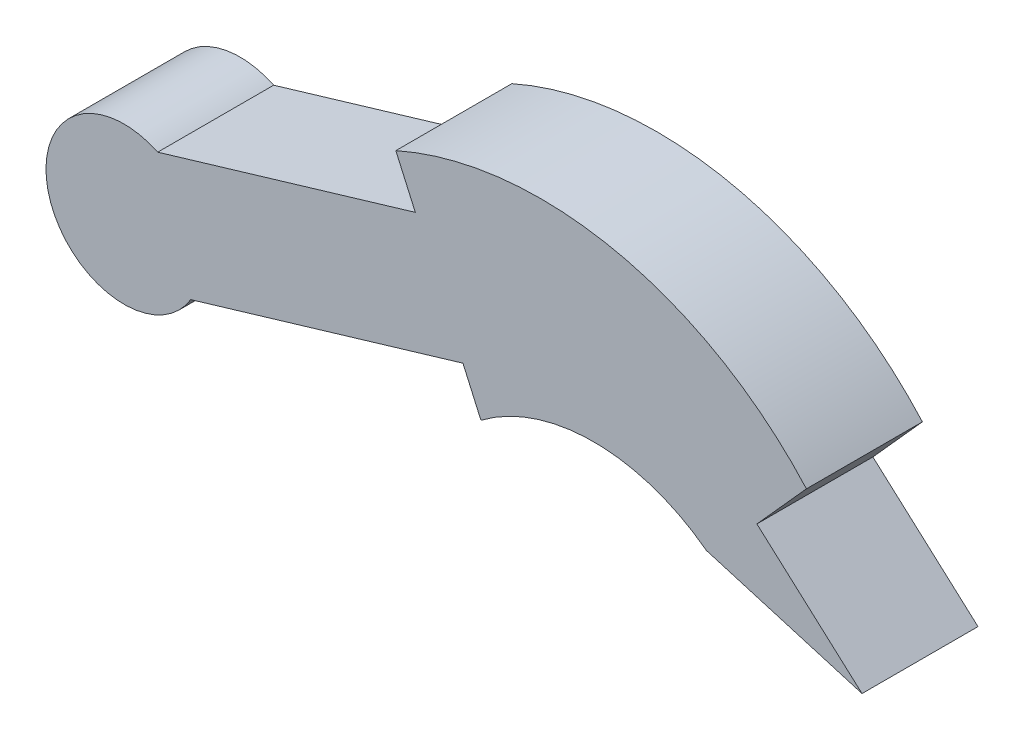
ISO-10303-21;
HEADER;
FILE_DESCRIPTION(('STEP AP214'),'2;1');
FILE_NAME('part.step','',(''),(''),'','','');
FILE_SCHEMA(('AUTOMOTIVE_DESIGN { 1 0 10303 214 1 1 1 1 }'));
ENDSEC;
DATA;
#1=APPLICATION_CONTEXT('core data for automotive mechanical design processes');
#2=APPLICATION_PROTOCOL_DEFINITION('international standard','automotive_design',2000,#1);
#3=PRODUCT_CONTEXT('',#1,'mechanical');
#4=PRODUCT('Part','Part','',(#3));
#5=PRODUCT_RELATED_PRODUCT_CATEGORY('part','',(#4));
#6=PRODUCT_DEFINITION_FORMATION('','',#4);
#7=PRODUCT_DEFINITION_CONTEXT('part definition',#1,'design');
#8=PRODUCT_DEFINITION('design','',#6,#7);
#9=PRODUCT_DEFINITION_SHAPE('','',#8);
#10=(LENGTH_UNIT() NAMED_UNIT(*) SI_UNIT(.MILLI.,.METRE.));
#11=(NAMED_UNIT(*) PLANE_ANGLE_UNIT() SI_UNIT($,.RADIAN.));
#12=(NAMED_UNIT(*) SI_UNIT($,.STERADIAN.) SOLID_ANGLE_UNIT());
#13=UNCERTAINTY_MEASURE_WITH_UNIT(LENGTH_MEASURE(1.E-05),#10,'distance_accuracy_value','');
#14=(GEOMETRIC_REPRESENTATION_CONTEXT(3) GLOBAL_UNCERTAINTY_ASSIGNED_CONTEXT((#13)) GLOBAL_UNIT_ASSIGNED_CONTEXT((#10,
#11,#12)) REPRESENTATION_CONTEXT('',''));
#15=CARTESIAN_POINT('',(0.,0.,0.));
#16=DIRECTION('',(0.,0.,1.));
#17=DIRECTION('',(1.,0.,0.));
#18=AXIS2_PLACEMENT_3D('',#15,#16,#17);
#19=CARTESIAN_POINT('',(24.5766985358955,0.531806480141832,-1.524));
#20=DIRECTION('',(0.,0.,1.));
#21=DIRECTION('',(1.,0.,0.));
#22=AXIS2_PLACEMENT_3D('',#19,#20,#21);
#23=CYLINDRICAL_SURFACE('',#22,1.02629268711818);
#24=CARTESIAN_POINT('',(24.5766985358955,0.531806480141832,0.));
#25=DIRECTION('',(0.,0.,1.));
#26=DIRECTION('',(-1.,0.,0.));
#27=AXIS2_PLACEMENT_3D('',#24,#25,#26);
#28=CIRCLE('',#27,1.02629268711818);
#29=CARTESIAN_POINT('',(25.018211481011,1.45827450383597,0.));
#30=VERTEX_POINT('',#29);
#31=CARTESIAN_POINT('',(25.4530060528673,-0.00238619608178983,0.));
#32=VERTEX_POINT('',#31);
#33=EDGE_CURVE('E142',#30,#32,#28,.T.);
#34=ORIENTED_EDGE('',*,*,#33,.F.);
#35=DIRECTION('',(0.,0.,1.));
#36=VECTOR('',#35,1.);
#37=CARTESIAN_POINT('',(25.018211481011,1.45827450383597,-1.524));
#38=LINE('',#37,#36);
#39=CARTESIAN_POINT('',(25.018211481011,1.45827450383597,-1.524));
#40=VERTEX_POINT('',#39);
#41=EDGE_CURVE('E11',#40,#30,#38,.T.);
#42=ORIENTED_EDGE('',*,*,#41,.F.);
#43=CARTESIAN_POINT('',(24.5766985358955,0.531806480141832,-1.524));
#44=DIRECTION('',(0.,0.,1.));
#45=DIRECTION('',(-1.,0.,0.));
#46=AXIS2_PLACEMENT_3D('',#43,#44,#45);
#47=CIRCLE('',#46,1.02629268711818);
#48=CARTESIAN_POINT('',(25.4530060528673,-0.00238619608178983,-1.524));
#49=VERTEX_POINT('',#48);
#50=EDGE_CURVE('E168',#40,#49,#47,.T.);
#51=ORIENTED_EDGE('',*,*,#50,.T.);
#52=DIRECTION('',(0.,0.,1.));
#53=VECTOR('',#52,1.);
#54=CARTESIAN_POINT('',(25.4530060528673,-0.00238619608178983,-1.524));
#55=LINE('',#54,#53);
#56=EDGE_CURVE('E36',#49,#32,#55,.T.);
#57=ORIENTED_EDGE('',*,*,#56,.T.);
#58=EDGE_LOOP('',(#34,#42,#51,#57));
#59=FACE_BOUND('',#58,.T.);
#60=ADVANCED_FACE('F33',(#59),#23,.T.);
#61=CARTESIAN_POINT('',(25.018211481011,1.45827450383597,-1.524));
#62=DIRECTION('',(-0.285298275496244,0.958438779473613,0.));
#63=DIRECTION('',(-0.958438779473613,-0.285298275496244,0.));
#64=AXIS2_PLACEMENT_3D('',#61,#62,#63);
#65=PLANE('',#64);
#66=DIRECTION('',(-0.958438779473613,-0.285298275496244,0.));
#67=VECTOR('',#66,1.);
#68=CARTESIAN_POINT('',(25.018211481011,1.45827450383597,0.));
#69=LINE('',#68,#67);
#70=CARTESIAN_POINT('',(28.4030245013134,2.46583110343419,0.));
#71=VERTEX_POINT('',#70);
#72=EDGE_CURVE('E166',#71,#30,#69,.T.);
#73=ORIENTED_EDGE('',*,*,#72,.F.);
#74=DIRECTION('',(0.,0.,1.));
#75=VECTOR('',#74,1.);
#76=CARTESIAN_POINT('',(28.4030245013134,2.46583110343419,-1.524));
#77=LINE('',#76,#75);
#78=CARTESIAN_POINT('',(28.4030245013134,2.46583110343419,-1.524));
#79=VERTEX_POINT('',#78);
#80=EDGE_CURVE('E42',#79,#71,#77,.T.);
#81=ORIENTED_EDGE('',*,*,#80,.F.);
#82=DIRECTION('',(-0.958438779473613,-0.285298275496244,0.));
#83=VECTOR('',#82,1.);
#84=CARTESIAN_POINT('',(25.018211481011,1.45827450383597,-1.524));
#85=LINE('',#84,#83);
#86=EDGE_CURVE('E132',#79,#40,#85,.T.);
#87=ORIENTED_EDGE('',*,*,#86,.T.);
#88=ORIENTED_EDGE('',*,*,#41,.T.);
#89=EDGE_LOOP('',(#73,#81,#87,#88));
#90=FACE_BOUND('',#89,.T.);
#91=ADVANCED_FACE('F184',(#90),#65,.T.);
#92=CARTESIAN_POINT('',(28.4030245013134,2.46583110343419,-1.524));
#93=DIRECTION('',(-0.913415067553765,-0.407029377767442,0.));
#94=DIRECTION('',(0.407029377767442,-0.913415067553765,0.));
#95=AXIS2_PLACEMENT_3D('',#92,#93,#94);
#96=PLANE('',#95);
#97=DIRECTION('',(0.407029377767442,-0.913415067553765,0.));
#98=VECTOR('',#97,1.);
#99=CARTESIAN_POINT('',(28.4030245013134,2.46583110343419,0.));
#100=LINE('',#99,#98);
#101=CARTESIAN_POINT('',(28.1470788066318,3.04019911411677,0.));
#102=VERTEX_POINT('',#101);
#103=EDGE_CURVE('E119',#102,#71,#100,.T.);
#104=ORIENTED_EDGE('',*,*,#103,.F.);
#105=DIRECTION('',(0.,0.,1.));
#106=VECTOR('',#105,1.);
#107=CARTESIAN_POINT('',(28.1470788066318,3.04019911411677,-1.524));
#108=LINE('',#107,#106);
#109=CARTESIAN_POINT('',(28.1470788066318,3.04019911411677,-1.524));
#110=VERTEX_POINT('',#109);
#111=EDGE_CURVE('E114',#110,#102,#108,.T.);
#112=ORIENTED_EDGE('',*,*,#111,.F.);
#113=DIRECTION('',(0.407029377767442,-0.913415067553765,0.));
#114=VECTOR('',#113,1.);
#115=CARTESIAN_POINT('',(28.4030245013134,2.46583110343419,-1.524));
#116=LINE('',#115,#114);
#117=EDGE_CURVE('E117',#110,#79,#116,.T.);
#118=ORIENTED_EDGE('',*,*,#117,.T.);
#119=ORIENTED_EDGE('',*,*,#80,.T.);
#120=EDGE_LOOP('',(#104,#112,#118,#119));
#121=FACE_BOUND('',#120,.T.);
#122=ADVANCED_FACE('F116',(#121),#96,.T.);
#123=CARTESIAN_POINT('',(30.054773069536,-1.23609077962368,-1.524));
#124=DIRECTION('',(0.,0.,1.));
#125=DIRECTION('',(1.,0.,0.));
#126=AXIS2_PLACEMENT_3D('',#123,#124,#125);
#127=CYLINDRICAL_SURFACE('',#126,4.68251563329203);
#128=CARTESIAN_POINT('',(30.054773069536,-1.23609077962368,0.));
#129=DIRECTION('',(0.,0.,1.));
#130=DIRECTION('',(-1.,0.,0.));
#131=AXIS2_PLACEMENT_3D('',#128,#129,#130);
#132=CIRCLE('',#131,4.68251563329203);
#133=CARTESIAN_POINT('',(33.5416639208679,1.88921638078821,0.));
#134=VERTEX_POINT('',#133);
#135=EDGE_CURVE('E163',#134,#102,#132,.T.);
#136=ORIENTED_EDGE('',*,*,#135,.F.);
#137=DIRECTION('',(0.,0.,1.));
#138=VECTOR('',#137,1.);
#139=CARTESIAN_POINT('',(33.5416639208679,1.88921638078821,-1.524));
#140=LINE('',#139,#138);
#141=CARTESIAN_POINT('',(33.5416639208679,1.88921638078821,-1.524));
#142=VERTEX_POINT('',#141);
#143=EDGE_CURVE('E124',#142,#134,#140,.T.);
#144=ORIENTED_EDGE('',*,*,#143,.F.);
#145=CARTESIAN_POINT('',(30.054773069536,-1.23609077962368,-1.524));
#146=DIRECTION('',(0.,0.,1.));
#147=DIRECTION('',(-1.,0.,0.));
#148=AXIS2_PLACEMENT_3D('',#145,#146,#147);
#149=CIRCLE('',#148,4.68251563329203);
#150=EDGE_CURVE('E130',#142,#110,#149,.T.);
#151=ORIENTED_EDGE('',*,*,#150,.T.);
#152=ORIENTED_EDGE('',*,*,#111,.T.);
#153=EDGE_LOOP('',(#136,#144,#151,#152));
#154=FACE_BOUND('',#153,.T.);
#155=ADVANCED_FACE('F134',(#154),#127,.T.);
#156=CARTESIAN_POINT('',(33.5416639208679,1.88921638078821,-1.524));
#157=DIRECTION('',(0.744198716002917,-0.667958285448731,0.));
#158=DIRECTION('',(0.667958285448731,0.744198716002918,0.));
#159=AXIS2_PLACEMENT_3D('',#156,#157,#158);
#160=PLANE('',#159);
#161=DIRECTION('',(0.667958285448731,0.744198716002918,0.));
#162=VECTOR('',#161,1.);
#163=CARTESIAN_POINT('',(33.5416639208679,1.88921638078821,0.));
#164=LINE('',#163,#162);
#165=CARTESIAN_POINT('',(32.8909765809129,1.16425990751301,0.));
#166=VERTEX_POINT('',#165);
#167=EDGE_CURVE('E160',#166,#134,#164,.T.);
#168=ORIENTED_EDGE('',*,*,#167,.F.);
#169=DIRECTION('',(0.,0.,1.));
#170=VECTOR('',#169,1.);
#171=CARTESIAN_POINT('',(32.8909765809129,1.16425990751301,-1.524));
#172=LINE('',#171,#170);
#173=CARTESIAN_POINT('',(32.8909765809129,1.16425990751301,-1.524));
#174=VERTEX_POINT('',#173);
#175=EDGE_CURVE('E172',#174,#166,#172,.T.);
#176=ORIENTED_EDGE('',*,*,#175,.F.);
#177=DIRECTION('',(0.667958285448731,0.744198716002918,0.));
#178=VECTOR('',#177,1.);
#179=CARTESIAN_POINT('',(33.5416639208679,1.88921638078821,-1.524));
#180=LINE('',#179,#178);
#181=EDGE_CURVE('E135',#174,#142,#180,.T.);
#182=ORIENTED_EDGE('',*,*,#181,.T.);
#183=ORIENTED_EDGE('',*,*,#143,.T.);
#184=EDGE_LOOP('',(#168,#176,#182,#183));
#185=FACE_BOUND('',#184,.T.);
#186=ADVANCED_FACE('F197',(#185),#160,.T.);
#187=CARTESIAN_POINT('',(32.8909765809129,1.16425990751301,-1.524));
#188=DIRECTION('',(0.667958285448731,0.744198716002918,0.));
#189=DIRECTION('',(-0.744198716002918,0.667958285448731,0.));
#190=AXIS2_PLACEMENT_3D('',#187,#188,#189);
#191=PLANE('',#190);
#192=DIRECTION('',(-0.744198716002918,0.667958285448731,0.));
#193=VECTOR('',#192,1.);
#194=CARTESIAN_POINT('',(32.8909765809129,1.16425990751301,0.));
#195=LINE('',#194,#193);
#196=CARTESIAN_POINT('',(34.2720428892628,-0.0753212199190146,0.));
#197=VERTEX_POINT('',#196);
#198=EDGE_CURVE('E157',#197,#166,#195,.T.);
#199=ORIENTED_EDGE('',*,*,#198,.F.);
#200=DIRECTION('',(0.,0.,1.));
#201=VECTOR('',#200,1.);
#202=CARTESIAN_POINT('',(34.2720428892628,-0.0753212199190146,-1.524));
#203=LINE('',#202,#201);
#204=CARTESIAN_POINT('',(34.2720428892628,-0.0753212199190146,-1.524));
#205=VERTEX_POINT('',#204);
#206=EDGE_CURVE('E174',#205,#197,#203,.T.);
#207=ORIENTED_EDGE('',*,*,#206,.F.);
#208=DIRECTION('',(-0.744198716002918,0.667958285448731,0.));
#209=VECTOR('',#208,1.);
#210=CARTESIAN_POINT('',(32.8909765809129,1.16425990751301,-1.524));
#211=LINE('',#210,#209);
#212=EDGE_CURVE('E137',#205,#174,#211,.T.);
#213=ORIENTED_EDGE('',*,*,#212,.T.);
#214=ORIENTED_EDGE('',*,*,#175,.T.);
#215=EDGE_LOOP('',(#199,#207,#213,#214));
#216=FACE_BOUND('',#215,.T.);
#217=ADVANCED_FACE('F200',(#216),#191,.T.);
#218=CARTESIAN_POINT('',(34.2720428892628,-0.0753212199190146,-1.524));
#219=DIRECTION('',(-0.284175145488044,-0.958772385233768,0.));
#220=DIRECTION('',(0.958772385233768,-0.284175145488044,0.));
#221=AXIS2_PLACEMENT_3D('',#218,#219,#220);
#222=PLANE('',#221);
#223=DIRECTION('',(0.958772385233768,-0.284175145488044,0.));
#224=VECTOR('',#223,1.);
#225=CARTESIAN_POINT('',(34.2720428892628,-0.0753212199190146,0.));
#226=LINE('',#225,#224);
#227=CARTESIAN_POINT('',(32.2264528664905,0.53098101748686,0.));
#228=VERTEX_POINT('',#227);
#229=EDGE_CURVE('E154',#228,#197,#226,.T.);
#230=ORIENTED_EDGE('',*,*,#229,.F.);
#231=DIRECTION('',(0.,0.,1.));
#232=VECTOR('',#231,1.);
#233=CARTESIAN_POINT('',(32.2264528664905,0.53098101748686,-1.524));
#234=LINE('',#233,#232);
#235=CARTESIAN_POINT('',(32.2264528664905,0.53098101748686,-1.524));
#236=VERTEX_POINT('',#235);
#237=EDGE_CURVE('E176',#236,#228,#234,.T.);
#238=ORIENTED_EDGE('',*,*,#237,.F.);
#239=DIRECTION('',(0.958772385233768,-0.284175145488044,0.));
#240=VECTOR('',#239,1.);
#241=CARTESIAN_POINT('',(34.2720428892628,-0.0753212199190146,-1.524));
#242=LINE('',#241,#240);
#243=EDGE_CURVE('E299',#236,#205,#242,.T.);
#244=ORIENTED_EDGE('',*,*,#243,.T.);
#245=ORIENTED_EDGE('',*,*,#206,.T.);
#246=EDGE_LOOP('',(#230,#238,#244,#245));
#247=FACE_BOUND('',#246,.T.);
#248=ADVANCED_FACE('F204',(#247),#222,.T.);
#249=CARTESIAN_POINT('',(30.7458355940205,-1.43031853422091,-1.524));
#250=DIRECTION('',(0.,0.,1.));
#251=DIRECTION('',(1.,0.,0.));
#252=AXIS2_PLACEMENT_3D('',#249,#250,#251);
#253=CYLINDRICAL_SURFACE('',#252,2.45742211251252);
#254=CARTESIAN_POINT('',(30.7458355940205,-1.43031853422091,0.));
#255=DIRECTION('',(0.,0.,-1.));
#256=DIRECTION('',(-1.,0.,0.));
#257=AXIS2_PLACEMENT_3D('',#254,#255,#256);
#258=CIRCLE('',#257,2.45742211251252);
#259=CARTESIAN_POINT('',(29.2652183215506,0.530981017486861,0.));
#260=VERTEX_POINT('',#259);
#261=EDGE_CURVE('E151',#260,#228,#258,.T.);
#262=ORIENTED_EDGE('',*,*,#261,.F.);
#263=DIRECTION('',(0.,0.,1.));
#264=VECTOR('',#263,1.);
#265=CARTESIAN_POINT('',(29.2652183215506,0.530981017486861,-1.524));
#266=LINE('',#265,#264);
#267=CARTESIAN_POINT('',(29.2652183215506,0.530981017486861,-1.524));
#268=VERTEX_POINT('',#267);
#269=EDGE_CURVE('E178',#268,#260,#266,.T.);
#270=ORIENTED_EDGE('',*,*,#269,.F.);
#271=CARTESIAN_POINT('',(30.7458355940205,-1.43031853422091,-1.524));
#272=DIRECTION('',(0.,0.,-1.));
#273=DIRECTION('',(-1.,0.,0.));
#274=AXIS2_PLACEMENT_3D('',#271,#272,#273);
#275=CIRCLE('',#274,2.45742211251252);
#276=EDGE_CURVE('E295',#268,#236,#275,.T.);
#277=ORIENTED_EDGE('',*,*,#276,.T.);
#278=ORIENTED_EDGE('',*,*,#237,.T.);
#279=EDGE_LOOP('',(#262,#270,#277,#278));
#280=FACE_BOUND('',#279,.T.);
#281=ADVANCED_FACE('F208',(#280),#253,.F.);
#282=CARTESIAN_POINT('',(29.2652183215506,0.53098101748686,-1.524));
#283=DIRECTION('',(-0.913415067553764,-0.407029377767445,0.));
#284=DIRECTION('',(0.407029377767445,-0.913415067553764,0.));
#285=AXIS2_PLACEMENT_3D('',#282,#283,#284);
#286=PLANE('',#285);
#287=DIRECTION('',(0.407029377767445,-0.913415067553764,0.));
#288=VECTOR('',#287,1.);
#289=CARTESIAN_POINT('',(29.2652183215506,0.53098101748686,0.));
#290=LINE('',#289,#288);
#291=CARTESIAN_POINT('',(29.0286064231583,1.06196203497373,0.));
#292=VERTEX_POINT('',#291);
#293=EDGE_CURVE('E148',#292,#260,#290,.T.);
#294=ORIENTED_EDGE('',*,*,#293,.F.);
#295=DIRECTION('',(0.,0.,1.));
#296=VECTOR('',#295,1.);
#297=CARTESIAN_POINT('',(29.0286064231583,1.06196203497373,-1.524));
#298=LINE('',#297,#296);
#299=CARTESIAN_POINT('',(29.0286064231583,1.06196203497373,-1.524));
#300=VERTEX_POINT('',#299);
#301=EDGE_CURVE('E179',#300,#292,#298,.T.);
#302=ORIENTED_EDGE('',*,*,#301,.F.);
#303=DIRECTION('',(0.407029377767445,-0.913415067553764,0.));
#304=VECTOR('',#303,1.);
#305=CARTESIAN_POINT('',(29.2652183215506,0.53098101748686,-1.524));
#306=LINE('',#305,#304);
#307=EDGE_CURVE('E306',#300,#268,#306,.T.);
#308=ORIENTED_EDGE('',*,*,#307,.T.);
#309=ORIENTED_EDGE('',*,*,#269,.T.);
#310=EDGE_LOOP('',(#294,#302,#308,#309));
#311=FACE_BOUND('',#310,.T.);
#312=ADVANCED_FACE('F212',(#311),#286,.T.);
#313=CARTESIAN_POINT('',(29.0286064231583,1.06196203497373,-1.524));
#314=DIRECTION('',(0.285298275496243,-0.958438779473613,0.));
#315=DIRECTION('',(0.958438779473613,0.285298275496244,0.));
#316=AXIS2_PLACEMENT_3D('',#313,#314,#315);
#317=PLANE('',#316);
#318=DIRECTION('',(0.958438779473613,0.285298275496243,0.));
#319=VECTOR('',#318,1.);
#320=CARTESIAN_POINT('',(29.0286064231583,1.06196203497373,0.));
#321=LINE('',#320,#319);
#322=EDGE_CURVE('E145',#32,#292,#321,.T.);
#323=ORIENTED_EDGE('',*,*,#322,.F.);
#324=ORIENTED_EDGE('',*,*,#56,.F.);
#325=DIRECTION('',(0.958438779473613,0.285298275496243,0.));
#326=VECTOR('',#325,1.);
#327=CARTESIAN_POINT('',(29.0286064231583,1.06196203497373,-1.524));
#328=LINE('',#327,#326);
#329=EDGE_CURVE('E308',#49,#300,#328,.T.);
#330=ORIENTED_EDGE('',*,*,#329,.T.);
#331=ORIENTED_EDGE('',*,*,#301,.T.);
#332=EDGE_LOOP('',(#323,#324,#330,#331));
#333=FACE_BOUND('',#332,.T.);
#334=ADVANCED_FACE('F181',(#333),#317,.T.);
#335=CARTESIAN_POINT('',(24.5766985358955,0.531806480141832,-1.524));
#336=DIRECTION('',(0.,0.,-1.));
#337=DIRECTION('',(-1.,0.,0.));
#338=AXIS2_PLACEMENT_3D('',#335,#336,#337);
#339=PLANE('',#338);
#340=ORIENTED_EDGE('',*,*,#50,.F.);
#341=ORIENTED_EDGE('',*,*,#86,.F.);
#342=ORIENTED_EDGE('',*,*,#117,.F.);
#343=ORIENTED_EDGE('',*,*,#150,.F.);
#344=ORIENTED_EDGE('',*,*,#181,.F.);
#345=ORIENTED_EDGE('',*,*,#212,.F.);
#346=ORIENTED_EDGE('',*,*,#243,.F.);
#347=ORIENTED_EDGE('',*,*,#276,.F.);
#348=ORIENTED_EDGE('',*,*,#307,.F.);
#349=ORIENTED_EDGE('',*,*,#329,.F.);
#350=EDGE_LOOP('',(#340,#341,#342,#343,#344,#345,#346,#347,#348,#349));
#351=FACE_BOUND('',#350,.T.);
#352=ADVANCED_FACE('F128',(#351),#339,.T.);
#353=CARTESIAN_POINT('',(24.5766985358955,0.531806480141832,0.));
#354=DIRECTION('',(0.,0.,-1.));
#355=DIRECTION('',(-1.,0.,0.));
#356=AXIS2_PLACEMENT_3D('',#353,#354,#355);
#357=PLANE('',#356);
#358=ORIENTED_EDGE('',*,*,#33,.T.);
#359=ORIENTED_EDGE('',*,*,#322,.T.);
#360=ORIENTED_EDGE('',*,*,#293,.T.);
#361=ORIENTED_EDGE('',*,*,#261,.T.);
#362=ORIENTED_EDGE('',*,*,#229,.T.);
#363=ORIENTED_EDGE('',*,*,#198,.T.);
#364=ORIENTED_EDGE('',*,*,#167,.T.);
#365=ORIENTED_EDGE('',*,*,#135,.T.);
#366=ORIENTED_EDGE('',*,*,#103,.T.);
#367=ORIENTED_EDGE('',*,*,#72,.T.);
#368=EDGE_LOOP('',(#358,#359,#360,#361,#362,#363,#364,#365,#366,#367));
#369=FACE_BOUND('',#368,.T.);
#370=ADVANCED_FACE('F183',(#369),#357,.F.);
#371=CLOSED_SHELL('',(#60,#91,#122,#155,#186,#217,#248,#281,#312,#334,#352,#370));
#372=MANIFOLD_SOLID_BREP('B2',#371);
#373=ADVANCED_BREP_SHAPE_REPRESENTATION('',(#18,#372),#14);
#374=SHAPE_DEFINITION_REPRESENTATION(#9,#373);
ENDSEC;
END-ISO-10303-21;
